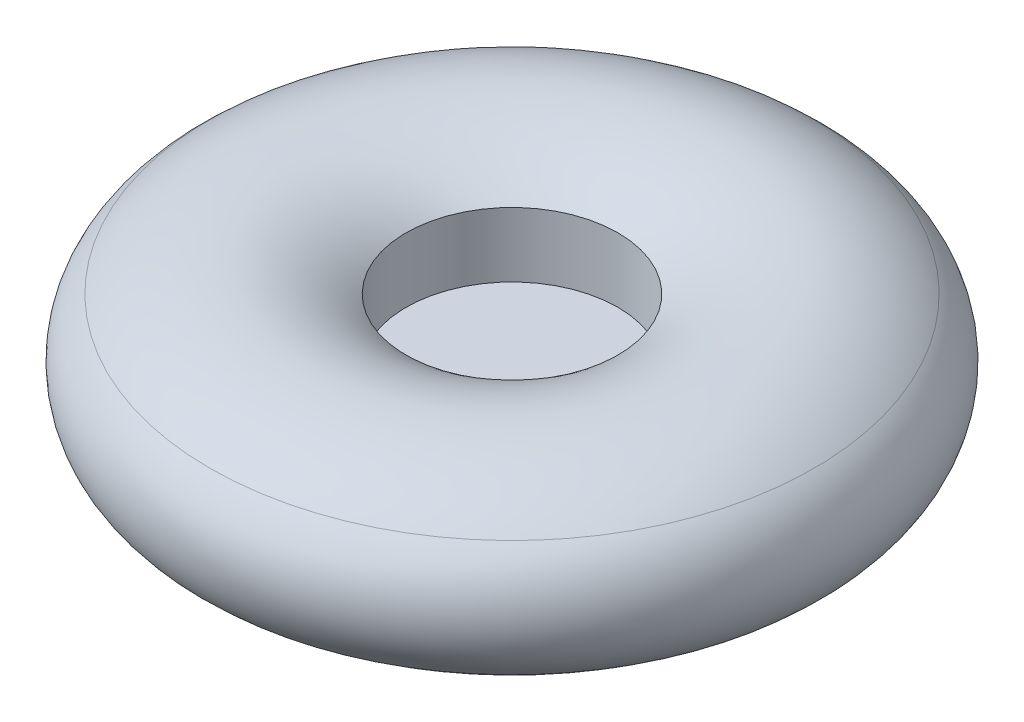
ISO-10303-21;
HEADER;
FILE_DESCRIPTION(('STEP AP214'),'2;1');
FILE_NAME('part.step','',(''),(''),'','','');
FILE_SCHEMA(('AUTOMOTIVE_DESIGN { 1 0 10303 214 1 1 1 1 }'));
ENDSEC;
DATA;
#1=APPLICATION_CONTEXT('core data for automotive mechanical design processes');
#2=APPLICATION_PROTOCOL_DEFINITION('international standard','automotive_design',2000,#1);
#3=PRODUCT_CONTEXT('',#1,'mechanical');
#4=PRODUCT('Part','Part','',(#3));
#5=PRODUCT_RELATED_PRODUCT_CATEGORY('part','',(#4));
#6=PRODUCT_DEFINITION_FORMATION('','',#4);
#7=PRODUCT_DEFINITION_CONTEXT('part definition',#1,'design');
#8=PRODUCT_DEFINITION('design','',#6,#7);
#9=PRODUCT_DEFINITION_SHAPE('','',#8);
#10=(LENGTH_UNIT() NAMED_UNIT(*) SI_UNIT(.MILLI.,.METRE.));
#11=(NAMED_UNIT(*) PLANE_ANGLE_UNIT() SI_UNIT($,.RADIAN.));
#12=(NAMED_UNIT(*) SI_UNIT($,.STERADIAN.) SOLID_ANGLE_UNIT());
#13=UNCERTAINTY_MEASURE_WITH_UNIT(LENGTH_MEASURE(1.E-05),#10,'distance_accuracy_value','');
#14=(GEOMETRIC_REPRESENTATION_CONTEXT(3) GLOBAL_UNCERTAINTY_ASSIGNED_CONTEXT((#13)) GLOBAL_UNIT_ASSIGNED_CONTEXT((#10,
#11,#12)) REPRESENTATION_CONTEXT('',''));
#15=CARTESIAN_POINT('',(0.,0.,0.));
#16=DIRECTION('',(0.,0.,1.));
#17=DIRECTION('',(1.,0.,0.));
#18=AXIS2_PLACEMENT_3D('',#15,#16,#17);
#19=CARTESIAN_POINT('',(57.1500000000003,-2.83442598456446,0.));
#20=DIRECTION('',(0.,-1.,0.));
#21=DIRECTION('',(0.,0.,-1.));
#22=AXIS2_PLACEMENT_3D('',#19,#20,#21);
#23=PLANE('',#22);
#24=CARTESIAN_POINT('',(0.,-2.8344259845644,0.));
#25=DIRECTION('',(0.,-1.,0.));
#26=DIRECTION('',(0.,0.,-1.));
#27=AXIS2_PLACEMENT_3D('',#24,#25,#26);
#28=CIRCLE('',#27,57.15);
#29=CARTESIAN_POINT('',(0.,-2.8344259845644,-57.15));
#30=VERTEX_POINT('',#29);
#31=EDGE_CURVE('E46',#30,#30,#28,.T.);
#32=ORIENTED_EDGE('',*,*,#31,.T.);
#33=EDGE_LOOP('',(#32));
#34=FACE_BOUND('',#33,.T.);
#35=ADVANCED_FACE('F24',(#34),#23,.T.);
#36=CARTESIAN_POINT('',(0.,1.92807401543499,0.));
#37=DIRECTION('',(0.,1.,0.));
#38=DIRECTION('',(0.,0.,1.));
#39=AXIS2_PLACEMENT_3D('',#36,#37,#38);
#40=PLANE('',#39);
#41=CARTESIAN_POINT('',(0.,1.92807401543499,0.));
#42=DIRECTION('',(0.,-1.,0.));
#43=DIRECTION('',(0.,0.,-1.));
#44=AXIS2_PLACEMENT_3D('',#41,#42,#43);
#45=CIRCLE('',#44,57.15);
#46=CARTESIAN_POINT('',(0.,1.92807401543499,-57.15));
#47=VERTEX_POINT('',#46);
#48=EDGE_CURVE('E10',#47,#47,#45,.T.);
#49=ORIENTED_EDGE('',*,*,#48,.F.);
#50=EDGE_LOOP('',(#49));
#51=FACE_BOUND('',#50,.T.);
#52=ADVANCED_FACE('F63',(#51),#40,.T.);
#53=CARTESIAN_POINT('',(0.,0.,0.));
#54=DIRECTION('',(0.,-1.,0.));
#55=DIRECTION('',(0.,0.,-1.));
#56=AXIS2_PLACEMENT_3D('',#53,#54,#55);
#57=CYLINDRICAL_SURFACE('',#56,57.15);
#58=ORIENTED_EDGE('',*,*,#48,.T.);
#59=EDGE_LOOP('',(#58));
#60=FACE_BOUND('',#59,.T.);
#61=CARTESIAN_POINT('',(-1.52655665885959E-13,36.750137113126,0.));
#62=DIRECTION('',(0.,-1.,0.));
#63=DIRECTION('',(0.,0.,-1.));
#64=AXIS2_PLACEMENT_3D('',#61,#62,#63);
#65=CIRCLE('',#64,57.15);
#66=CARTESIAN_POINT('',(-1.52655665885959E-13,36.750137113126,-57.15));
#67=VERTEX_POINT('',#66);
#68=EDGE_CURVE('E30',#67,#67,#65,.T.);
#69=ORIENTED_EDGE('',*,*,#68,.F.);
#70=EDGE_LOOP('',(#69));
#71=FACE_BOUND('',#70,.T.);
#72=ADVANCED_FACE('F67',(#60,#71),#57,.F.);
#73=CARTESIAN_POINT('',(0.,-27.8272385796334,0.));
#74=DIRECTION('',(0.,-1.,0.));
#75=DIRECTION('',(0.,0.,-1.));
#76=AXIS2_PLACEMENT_3D('',#73,#74,#75);
#77=TOROIDAL_SURFACE('',#76,110.052624851877,83.4800884497744);
#78=ORIENTED_EDGE('',*,*,#68,.T.);
#79=EDGE_LOOP('',(#78));
#80=FACE_BOUND('',#79,.T.);
#81=CARTESIAN_POINT('',(-1.52655665885959E-13,36.750137113126,0.));
#82=DIRECTION('',(0.,-1.,0.));
#83=DIRECTION('',(0.,0.,-1.));
#84=AXIS2_PLACEMENT_3D('',#81,#82,#83);
#85=CIRCLE('',#84,162.955249703754);
#86=CARTESIAN_POINT('',(-1.52655665885959E-13,36.750137113126,-162.955249703754));
#87=VERTEX_POINT('',#86);
#88=EDGE_CURVE('E34',#87,#87,#85,.T.);
#89=ORIENTED_EDGE('',*,*,#88,.F.);
#90=EDGE_LOOP('',(#89));
#91=FACE_BOUND('',#90,.T.);
#92=ADVANCED_FACE('F72',(#80,#91),#77,.T.);
#93=CARTESIAN_POINT('',(0.,5.39910585846731,0.));
#94=DIRECTION('',(0.,-1.,0.));
#95=DIRECTION('',(0.,0.,-1.));
#96=AXIS2_PLACEMENT_3D('',#93,#94,#95);
#97=TOROIDAL_SURFACE('',#96,137.272077735361,40.5279222646394);
#98=ORIENTED_EDGE('',*,*,#88,.T.);
#99=EDGE_LOOP('',(#98));
#100=FACE_BOUND('',#99,.T.);
#101=CARTESIAN_POINT('',(0.,-25.9519253961913,0.));
#102=DIRECTION('',(0.,-1.,0.));
#103=DIRECTION('',(0.,0.,-1.));
#104=AXIS2_PLACEMENT_3D('',#101,#102,#103);
#105=CIRCLE('',#104,162.955249703754);
#106=CARTESIAN_POINT('',(0.,-25.9519253961913,-162.955249703754));
#107=VERTEX_POINT('',#106);
#108=EDGE_CURVE('E38',#107,#107,#105,.T.);
#109=ORIENTED_EDGE('',*,*,#108,.F.);
#110=EDGE_LOOP('',(#109));
#111=FACE_BOUND('',#110,.T.);
#112=ADVANCED_FACE('F59',(#100,#111),#97,.T.);
#113=CARTESIAN_POINT('',(0.,38.6254502965674,0.));
#114=DIRECTION('',(0.,-1.,0.));
#115=DIRECTION('',(0.,0.,-1.));
#116=AXIS2_PLACEMENT_3D('',#113,#114,#115);
#117=TOROIDAL_SURFACE('',#116,110.052624851877,83.4800884497742);
#118=ORIENTED_EDGE('',*,*,#108,.T.);
#119=EDGE_LOOP('',(#118));
#120=FACE_BOUND('',#119,.T.);
#121=CARTESIAN_POINT('',(0.,-25.9519253961912,0.));
#122=DIRECTION('',(0.,-1.,0.));
#123=DIRECTION('',(0.,0.,-1.));
#124=AXIS2_PLACEMENT_3D('',#121,#122,#123);
#125=CIRCLE('',#124,57.15);
#126=CARTESIAN_POINT('',(0.,-25.9519253961912,-57.15));
#127=VERTEX_POINT('',#126);
#128=EDGE_CURVE('E43',#127,#127,#125,.T.);
#129=ORIENTED_EDGE('',*,*,#128,.F.);
#130=EDGE_LOOP('',(#129));
#131=FACE_BOUND('',#130,.T.);
#132=ADVANCED_FACE('F53',(#120,#131),#117,.T.);
#133=CARTESIAN_POINT('',(0.,0.,0.));
#134=DIRECTION('',(0.,-1.,0.));
#135=DIRECTION('',(0.,0.,-1.));
#136=AXIS2_PLACEMENT_3D('',#133,#134,#135);
#137=CYLINDRICAL_SURFACE('',#136,57.15);
#138=ORIENTED_EDGE('',*,*,#128,.T.);
#139=EDGE_LOOP('',(#138));
#140=FACE_BOUND('',#139,.T.);
#141=ORIENTED_EDGE('',*,*,#31,.F.);
#142=EDGE_LOOP('',(#141));
#143=FACE_BOUND('',#142,.T.);
#144=ADVANCED_FACE('F51',(#140,#143),#137,.F.);
#145=CLOSED_SHELL('',(#35,#52,#72,#92,#112,#132,#144));
#146=MANIFOLD_SOLID_BREP('B2',#145);
#147=ADVANCED_BREP_SHAPE_REPRESENTATION('',(#18,#146),#14);
#148=SHAPE_DEFINITION_REPRESENTATION(#9,#147);
ENDSEC;
END-ISO-10303-21;
